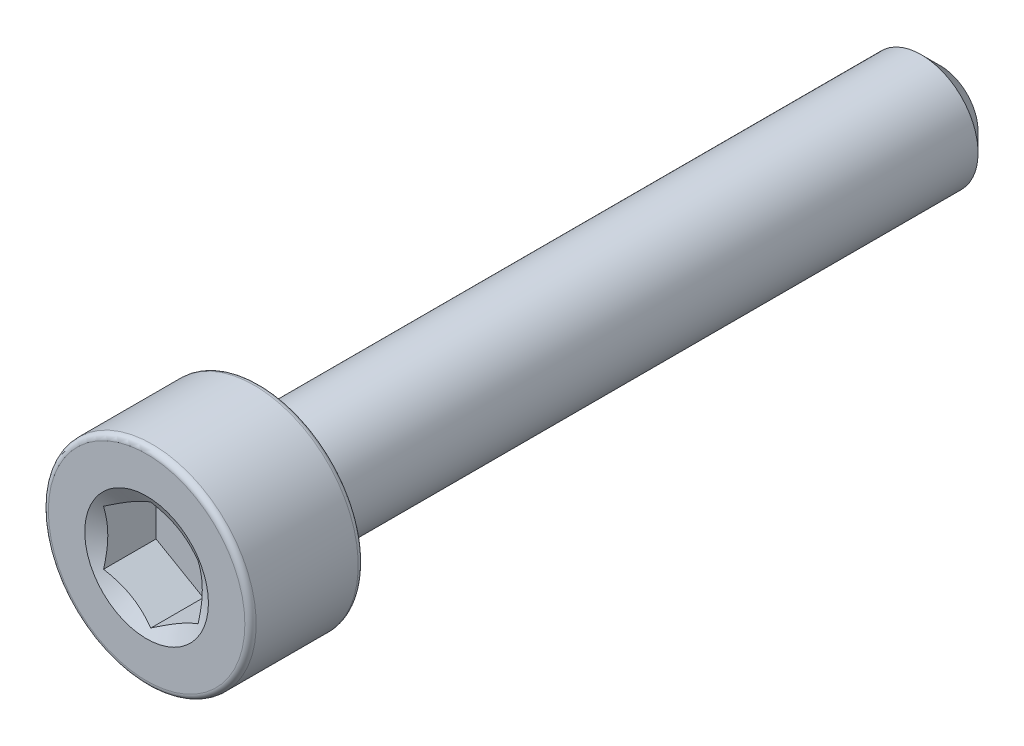
ISO-10303-21;
HEADER;
FILE_DESCRIPTION(('STEP AP214'),'2;1');
FILE_NAME('part.step','',(''),(''),'','','');
FILE_SCHEMA(('AUTOMOTIVE_DESIGN { 1 0 10303 214 1 1 1 1 }'));
ENDSEC;
DATA;
#1=APPLICATION_CONTEXT('core data for automotive mechanical design processes');
#2=APPLICATION_PROTOCOL_DEFINITION('international standard','automotive_design',2000,#1);
#3=PRODUCT_CONTEXT('',#1,'mechanical');
#4=PRODUCT('Part','Part','',(#3));
#5=PRODUCT_RELATED_PRODUCT_CATEGORY('part','',(#4));
#6=PRODUCT_DEFINITION_FORMATION('','',#4);
#7=PRODUCT_DEFINITION_CONTEXT('part definition',#1,'design');
#8=PRODUCT_DEFINITION('design','',#6,#7);
#9=PRODUCT_DEFINITION_SHAPE('','',#8);
#10=(LENGTH_UNIT() NAMED_UNIT(*) SI_UNIT(.MILLI.,.METRE.));
#11=(NAMED_UNIT(*) PLANE_ANGLE_UNIT() SI_UNIT($,.RADIAN.));
#12=(NAMED_UNIT(*) SI_UNIT($,.STERADIAN.) SOLID_ANGLE_UNIT());
#13=UNCERTAINTY_MEASURE_WITH_UNIT(LENGTH_MEASURE(1.E-05),#10,'distance_accuracy_value','');
#14=(GEOMETRIC_REPRESENTATION_CONTEXT(3) GLOBAL_UNCERTAINTY_ASSIGNED_CONTEXT((#13)) GLOBAL_UNIT_ASSIGNED_CONTEXT((#10,
#11,#12)) REPRESENTATION_CONTEXT('',''));
#15=CARTESIAN_POINT('',(0.,0.,0.));
#16=DIRECTION('',(0.,0.,1.));
#17=DIRECTION('',(1.,0.,0.));
#18=AXIS2_PLACEMENT_3D('',#15,#16,#17);
#19=CARTESIAN_POINT('',(0.,0.,-10.5));
#20=DIRECTION('',(0.,0.,-1.));
#21=DIRECTION('',(-1.,0.,0.));
#22=AXIS2_PLACEMENT_3D('',#19,#20,#21);
#23=PLANE('',#22);
#24=CARTESIAN_POINT('',(0.,0.,-10.5));
#25=DIRECTION('',(0.,0.,-1.));
#26=DIRECTION('',(-1.,0.,0.));
#27=AXIS2_PLACEMENT_3D('',#24,#25,#26);
#28=CIRCLE('',#27,1.00000000000001);
#29=CARTESIAN_POINT('',(-1.00000000000001,0.,-10.5));
#30=VERTEX_POINT('',#29);
#31=EDGE_CURVE('E59',#30,#30,#28,.T.);
#32=ORIENTED_EDGE('',*,*,#31,.T.);
#33=EDGE_LOOP('',(#32));
#34=FACE_BOUND('',#33,.T.);
#35=ADVANCED_FACE('F45',(#34),#23,.T.);
#36=CARTESIAN_POINT('',(0.,0.,-10.5));
#37=DIRECTION('',(0.,0.,1.));
#38=DIRECTION('',(1.,0.,0.));
#39=AXIS2_PLACEMENT_3D('',#36,#37,#38);
#40=CONICAL_SURFACE('',#39,1.00000000000001,0.785398163397449);
#41=CARTESIAN_POINT('',(0.,0.,-10.));
#42=DIRECTION('',(0.,0.,-1.));
#43=DIRECTION('',(-1.,0.,0.));
#44=AXIS2_PLACEMENT_3D('',#41,#42,#43);
#45=CIRCLE('',#44,1.50000000000001);
#46=CARTESIAN_POINT('',(-1.50000000000001,0.,-10.));
#47=VERTEX_POINT('',#46);
#48=EDGE_CURVE('E153',#47,#47,#45,.T.);
#49=ORIENTED_EDGE('',*,*,#48,.T.);
#50=EDGE_LOOP('',(#49));
#51=FACE_BOUND('',#50,.T.);
#52=ORIENTED_EDGE('',*,*,#31,.F.);
#53=EDGE_LOOP('',(#52));
#54=FACE_BOUND('',#53,.T.);
#55=ADVANCED_FACE('F161',(#51,#54),#40,.T.);
#56=CARTESIAN_POINT('',(0.,0.,-10.5));
#57=DIRECTION('',(0.,0.,-1.));
#58=DIRECTION('',(-1.,0.,0.));
#59=AXIS2_PLACEMENT_3D('',#56,#57,#58);
#60=CYLINDRICAL_SURFACE('',#59,1.50000000000001);
#61=CARTESIAN_POINT('',(0.,0.,7.5));
#62=DIRECTION('',(0.,0.,-1.));
#63=DIRECTION('',(-1.,0.,0.));
#64=AXIS2_PLACEMENT_3D('',#61,#62,#63);
#65=CIRCLE('',#64,1.5);
#66=CARTESIAN_POINT('',(-1.5,0.,7.5));
#67=VERTEX_POINT('',#66);
#68=EDGE_CURVE('E149',#67,#67,#65,.T.);
#69=ORIENTED_EDGE('',*,*,#68,.T.);
#70=EDGE_LOOP('',(#69));
#71=FACE_BOUND('',#70,.T.);
#72=ORIENTED_EDGE('',*,*,#48,.F.);
#73=EDGE_LOOP('',(#72));
#74=FACE_BOUND('',#73,.T.);
#75=ADVANCED_FACE('F163',(#71,#74),#60,.T.);
#76=CARTESIAN_POINT('',(0.,1.5,7.5));
#77=DIRECTION('',(0.,0.,-1.));
#78=DIRECTION('',(-1.,0.,0.));
#79=AXIS2_PLACEMENT_3D('',#76,#77,#78);
#80=PLANE('',#79);
#81=CARTESIAN_POINT('',(0.,0.,7.5));
#82=DIRECTION('',(0.,0.,-1.));
#83=DIRECTION('',(-1.,0.,0.));
#84=AXIS2_PLACEMENT_3D('',#81,#82,#83);
#85=CIRCLE('',#84,2.6);
#86=CARTESIAN_POINT('',(-2.6,0.,7.5));
#87=VERTEX_POINT('',#86);
#88=EDGE_CURVE('E145',#87,#87,#85,.T.);
#89=ORIENTED_EDGE('',*,*,#88,.T.);
#90=EDGE_LOOP('',(#89));
#91=FACE_BOUND('',#90,.T.);
#92=ORIENTED_EDGE('',*,*,#68,.F.);
#93=EDGE_LOOP('',(#92));
#94=FACE_BOUND('',#93,.T.);
#95=ADVANCED_FACE('F169',(#91,#94),#80,.T.);
#96=CARTESIAN_POINT('',(0.,0.,7.65));
#97=DIRECTION('',(0.,0.,-1.));
#98=DIRECTION('',(-1.,0.,0.));
#99=AXIS2_PLACEMENT_3D('',#96,#97,#98);
#100=TOROIDAL_SURFACE('',#99,2.6,0.15);
#101=CARTESIAN_POINT('',(0.,0.,7.65));
#102=DIRECTION('',(0.,0.,-1.));
#103=DIRECTION('',(-1.,0.,0.));
#104=AXIS2_PLACEMENT_3D('',#101,#102,#103);
#105=CIRCLE('',#104,2.75);
#106=CARTESIAN_POINT('',(-2.75,0.,7.65));
#107=VERTEX_POINT('',#106);
#108=EDGE_CURVE('E141',#107,#107,#105,.T.);
#109=ORIENTED_EDGE('',*,*,#108,.T.);
#110=EDGE_LOOP('',(#109));
#111=FACE_BOUND('',#110,.T.);
#112=ORIENTED_EDGE('',*,*,#88,.F.);
#113=EDGE_LOOP('',(#112));
#114=FACE_BOUND('',#113,.T.);
#115=ADVANCED_FACE('F175',(#111,#114),#100,.T.);
#116=CARTESIAN_POINT('',(0.,0.,-10.5));
#117=DIRECTION('',(0.,0.,-1.));
#118=DIRECTION('',(-1.,0.,0.));
#119=AXIS2_PLACEMENT_3D('',#116,#117,#118);
#120=CYLINDRICAL_SURFACE('',#119,2.75);
#121=CARTESIAN_POINT('',(0.,0.,10.35));
#122=DIRECTION('',(0.,0.,-1.));
#123=DIRECTION('',(-1.,0.,0.));
#124=AXIS2_PLACEMENT_3D('',#121,#122,#123);
#125=CIRCLE('',#124,2.75);
#126=CARTESIAN_POINT('',(-2.75,0.,10.35));
#127=VERTEX_POINT('',#126);
#128=EDGE_CURVE('E137',#127,#127,#125,.T.);
#129=ORIENTED_EDGE('',*,*,#128,.T.);
#130=EDGE_LOOP('',(#129));
#131=FACE_BOUND('',#130,.T.);
#132=ORIENTED_EDGE('',*,*,#108,.F.);
#133=EDGE_LOOP('',(#132));
#134=FACE_BOUND('',#133,.T.);
#135=ADVANCED_FACE('F179',(#131,#134),#120,.T.);
#136=CARTESIAN_POINT('',(0.,0.,10.35));
#137=DIRECTION('',(0.,0.,-1.));
#138=DIRECTION('',(-1.,0.,0.));
#139=AXIS2_PLACEMENT_3D('',#136,#137,#138);
#140=TOROIDAL_SURFACE('',#139,2.6,0.15);
#141=CARTESIAN_POINT('',(0.,0.,10.5));
#142=DIRECTION('',(0.,0.,-1.));
#143=DIRECTION('',(-1.,0.,0.));
#144=AXIS2_PLACEMENT_3D('',#141,#142,#143);
#145=CIRCLE('',#144,2.6);
#146=CARTESIAN_POINT('',(-2.6,0.,10.5));
#147=VERTEX_POINT('',#146);
#148=EDGE_CURVE('E133',#147,#147,#145,.T.);
#149=ORIENTED_EDGE('',*,*,#148,.T.);
#150=EDGE_LOOP('',(#149));
#151=FACE_BOUND('',#150,.T.);
#152=ORIENTED_EDGE('',*,*,#128,.F.);
#153=EDGE_LOOP('',(#152));
#154=FACE_BOUND('',#153,.T.);
#155=ADVANCED_FACE('F183',(#151,#154),#140,.T.);
#156=CARTESIAN_POINT('',(0.,2.6,10.5));
#157=DIRECTION('',(0.,0.,1.));
#158=DIRECTION('',(1.,0.,0.));
#159=AXIS2_PLACEMENT_3D('',#156,#157,#158);
#160=PLANE('',#159);
#161=CARTESIAN_POINT('',(0.,0.,10.5));
#162=DIRECTION('',(0.,0.,1.));
#163=DIRECTION('',(1.,0.,0.));
#164=AXIS2_PLACEMENT_3D('',#161,#162,#163);
#165=CIRCLE('',#164,1.63614639414505);
#166=CARTESIAN_POINT('',(1.63614639414505,0.,10.5));
#167=VERTEX_POINT('',#166);
#168=EDGE_CURVE('E291',#167,#167,#165,.T.);
#169=ORIENTED_EDGE('',*,*,#168,.F.);
#170=EDGE_LOOP('',(#169));
#171=FACE_BOUND('',#170,.T.);
#172=ORIENTED_EDGE('',*,*,#148,.F.);
#173=EDGE_LOOP('',(#172));
#174=FACE_BOUND('',#173,.T.);
#175=ADVANCED_FACE('F187',(#171,#174),#160,.T.);
#176=CARTESIAN_POINT('',(0.,0.,10.5));
#177=DIRECTION('',(0.,0.,1.));
#178=DIRECTION('',(1.,0.,0.));
#179=AXIS2_PLACEMENT_3D('',#176,#177,#178);
#180=CONICAL_SURFACE('',#179,1.63614639414505,1.0471975511966);
#181=ORIENTED_EDGE('',*,*,#168,.T.);
#182=EDGE_LOOP('',(#181));
#183=FACE_BOUND('',#182,.T.);
#184=CARTESIAN_POINT('',(1.2502,0.721572366433195,10.3887704469061));
#185=CARTESIAN_POINT('',(1.19526669476823,0.75328812499623,10.3704496870037));
#186=CARTESIAN_POINT('',(1.13985921349976,0.785277649221703,10.3537870784407));
#187=CARTESIAN_POINT('',(1.02808463239966,0.849810733708404,10.3247010761858));
#188=CARTESIAN_POINT('',(0.971715545158286,0.882355441401182,10.3122879742161));
#189=CARTESIAN_POINT('',(0.859676025913012,0.947041487997317,10.2929634598761));
#190=CARTESIAN_POINT('',(0.804022841540767,0.979172868975893,10.2859234616875));
#191=CARTESIAN_POINT('',(0.692454346091606,1.04358696985655,10.2775162048707));
#192=CARTESIAN_POINT('',(0.636539441062397,1.07586945532687,10.2761419874448));
#193=CARTESIAN_POINT('',(0.532042078818273,1.13620103554812,10.278987109608));
#194=CARTESIAN_POINT('',(0.483444050118682,1.16425912049992,10.2825078710601));
#195=CARTESIAN_POINT('',(0.38656463782676,1.22019247526559,10.2936708849393));
#196=CARTESIAN_POINT('',(0.338283589807835,1.24806755133608,10.3013169578127));
#197=CARTESIAN_POINT('',(0.241204116145956,1.30411641158755,10.3204332269406));
#198=CARTESIAN_POINT('',(0.1924179896481,1.33228309485381,10.3319845292197));
#199=CARTESIAN_POINT('',(0.095573747707898,1.38819614400745,10.3582020869339));
#200=CARTESIAN_POINT('',(0.0475143896730361,1.41594322730595,10.3728621743792));
#201=CARTESIAN_POINT('',(-0.00019999999999937,1.4434911430279,10.3887704469061));
#202=B_SPLINE_CURVE_WITH_KNOTS('',3,(#184,#185,#186,#187,#188,#189,#190,#191,#192,#193,#194,
#195,#196,#197,#198,#199,#200,#201),.UNSPECIFIED.,.F.,.F.,(4,2,2,2,2,2,2,2,4),(0.,
0.198150821029559,0.396778196315219,0.590488617354398,0.783961049317179,0.952480056398643,
1.12115539730009,1.29357430343589,1.4656542697693),.UNSPECIFIED.);
#203=CARTESIAN_POINT('',(1.25,0.721687836487033,10.3887037722401));
#204=VERTEX_POINT('',#203);
#205=CARTESIAN_POINT('',(0.,1.44337567297406,10.3887037722401));
#206=VERTEX_POINT('',#205);
#207=EDGE_CURVE('E114',#204,#206,#202,.T.);
#208=ORIENTED_EDGE('',*,*,#207,.F.);
#209=CARTESIAN_POINT('',(1.25,-1.89493751841897,10.8660049161367));
#210=CARTESIAN_POINT('',(1.25,-1.84067066556792,10.8398591369801));
#211=CARTESIAN_POINT('',(1.25,-1.78627450163045,10.813977180104));
#212=CARTESIAN_POINT('',(1.25,-1.67715428612257,10.7628901449648));
#213=CARTESIAN_POINT('',(1.25,-1.62243018009227,10.737685183164));
#214=CARTESIAN_POINT('',(1.25,-1.51228150662671,10.6879651495794));
#215=CARTESIAN_POINT('',(1.25,-1.45685471366198,10.6634549865724));
#216=CARTESIAN_POINT('',(1.25,-1.34554530713432,10.6154991246428));
#217=CARTESIAN_POINT('',(1.25,-1.28966271673333,10.5920533720234));
#218=CARTESIAN_POINT('',(1.25,-1.17576624469794,10.5458644070182));
#219=CARTESIAN_POINT('',(1.25,-1.11773662340457,10.5231594973456));
#220=CARTESIAN_POINT('',(1.25,-1.00099484940808,10.4795841161114));
#221=CARTESIAN_POINT('',(1.25,-0.942282613121023,10.4587138719349));
#222=CARTESIAN_POINT('',(1.25,-0.765204349699312,10.3997072191848));
#223=CARTESIAN_POINT('',(1.25,-0.645583882604636,10.3650422189823));
#224=CARTESIAN_POINT('',(1.25,-0.463875702211922,10.3244838282877));
#225=CARTESIAN_POINT('',(1.25,-0.403068506127652,10.3128844610448));
#226=CARTESIAN_POINT('',(1.25,-0.280742753477133,10.2942518454792));
#227=CARTESIAN_POINT('',(1.25,-0.219224254752231,10.2872182285025));
#228=CARTESIAN_POINT('',(1.25,-0.0965698763633008,10.2783680226508));
#229=CARTESIAN_POINT('',(1.25,-0.0354387064012569,10.2764878457648));
#230=CARTESIAN_POINT('',(1.25,0.0867606380980666,10.2779328141762));
#231=CARTESIAN_POINT('',(1.25,0.14782880910327,10.2812582369791));
#232=CARTESIAN_POINT('',(1.25,0.296976974537503,10.2954442054338));
#233=CARTESIAN_POINT('',(1.25,0.384798095194578,10.3090299024726));
#234=CARTESIAN_POINT('',(1.25,0.558777035598955,10.3444719080705));
#235=CARTESIAN_POINT('',(1.25,0.644932779103955,10.3663379185543));
#236=CARTESIAN_POINT('',(1.25,0.77380914521683,10.4038729521391));
#237=CARTESIAN_POINT('',(1.25,0.817192381770243,10.4173527933513));
#238=CARTESIAN_POINT('',(1.25,0.903507427606639,10.4456064722738));
#239=CARTESIAN_POINT('',(1.25,0.946439496819678,10.4603795133203));
#240=CARTESIAN_POINT('',(1.25,1.03190818876533,10.4910007062678));
#241=CARTESIAN_POINT('',(1.25,1.07444487146017,10.5068486920207));
#242=CARTESIAN_POINT('',(1.25,1.15917932142556,10.5394435314668));
#243=CARTESIAN_POINT('',(1.25,1.20137703158446,10.5561905331241));
#244=CARTESIAN_POINT('',(1.25,1.31147066876873,10.6010154406074));
#245=CARTESIAN_POINT('',(1.25,1.37912101231521,10.629695951964));
#246=CARTESIAN_POINT('',(1.25,1.51378271027518,10.6885240272895));
#247=CARTESIAN_POINT('',(1.25,1.58079400938027,10.7186717168868));
#248=CARTESIAN_POINT('',(1.25,1.78108956690742,10.810786011249));
#249=CARTESIAN_POINT('',(1.25,1.91360872407254,10.8744125929199));
#250=CARTESIAN_POINT('',(1.25,2.1774904257741,11.0044258505658));
#251=CARTESIAN_POINT('',(1.25,2.3088511775619,11.0708161192718));
#252=CARTESIAN_POINT('',(1.25,2.57065126493254,11.2053391118779));
#253=CARTESIAN_POINT('',(1.25,2.70109073234425,11.2734715797604));
#254=CARTESIAN_POINT('',(1.25,2.948502633735,11.4041482033026));
#255=CARTESIAN_POINT('',(1.25,3.06553428022911,11.4665806590823));
#256=CARTESIAN_POINT('',(1.25,3.29922001609874,11.5921595961625));
#257=CARTESIAN_POINT('',(1.25,3.41587408905205,11.6553061079975));
#258=CARTESIAN_POINT('',(1.25,3.64856969129762,11.7819563109881));
#259=CARTESIAN_POINT('',(1.25,3.76461202239064,11.8454585309991));
#260=CARTESIAN_POINT('',(1.25,3.99646186524789,11.9728743669845));
#261=CARTESIAN_POINT('',(1.25,4.1122693903372,12.036787958703));
#262=CARTESIAN_POINT('',(1.25,4.2279932107486,12.1008518334656));
#263=B_SPLINE_CURVE_WITH_KNOTS('',3,(#209,#210,#211,#212,#213,#214,#215,#216,#217,#218,#219,
#220,#221,#222,#223,#224,#225,#226,#227,#228,#229,#230,#231,#232,#233,#234,#235,#236,#237,#238,
#239,#240,#241,#242,#243,#244,#245,#246,#247,#248,#249,#250,#251,#252,#253,#254,#255,#256,#257,
#258,#259,#260,#261,#262),.UNSPECIFIED.,.F.,.F.,(4,2,2,2,2,2,2,2,2,2,2,2,2,2,2,2,2,2,2,2,2,2,2,
2,2,2,4),(0.,0.180713106713346,0.361457104680117,0.543260352914665,0.725054419431095,
0.911961247339337,1.09889120758174,1.4717330826098,1.65730634847845,1.84286462866529,
2.02612278279417,2.20939070656818,2.47544204670161,2.74180608477099,2.87807807884381,
3.01426670678608,3.15043433259021,3.28662443861176,3.50703539675674,3.72746526112046,
4.1684120268283,4.60995110059888,5.05142565856186,5.44935247283763,5.84729636804963,
6.24413951205772,6.64095946715193),.UNSPECIFIED.);
#264=CARTESIAN_POINT('',(1.25,-0.721687836487029,10.38870377224));
#265=VERTEX_POINT('',#264);
#266=EDGE_CURVE('E233',#265,#204,#263,.T.);
#267=ORIENTED_EDGE('',*,*,#266,.F.);
#268=CARTESIAN_POINT('',(-0.000200000000002283,-1.4434911430279,10.3887704469061));
#269=CARTESIAN_POINT('',(0.0547333052317625,-1.41177538446486,10.3704496870037));
#270=CARTESIAN_POINT('',(0.110140786500237,-1.37978586023939,10.3537870784407));
#271=CARTESIAN_POINT('',(0.221915367600337,-1.31525277575269,10.3247010761858));
#272=CARTESIAN_POINT('',(0.278284454841707,-1.28270806805991,10.3122879742161));
#273=CARTESIAN_POINT('',(0.39032397408698,-1.21802202146378,10.2929634598761));
#274=CARTESIAN_POINT('',(0.445977158459225,-1.1858906404852,10.2859234616875));
#275=CARTESIAN_POINT('',(0.557545653908387,-1.12147653960455,10.2775162048707));
#276=CARTESIAN_POINT('',(0.613460558937595,-1.08919405413422,10.2761419874448));
#277=CARTESIAN_POINT('',(0.71795792118172,-1.02886247391297,10.278987109608));
#278=CARTESIAN_POINT('',(0.766555949881311,-1.00080438896117,10.2825078710601));
#279=CARTESIAN_POINT('',(0.863435362173233,-0.9448710341955,10.2936708849393));
#280=CARTESIAN_POINT('',(0.911716410192158,-0.916995958125017,10.3013169578127));
#281=CARTESIAN_POINT('',(1.00879588385404,-0.860947097873543,10.3204332269406));
#282=CARTESIAN_POINT('',(1.05758201035189,-0.832780414607287,10.3319845292197));
#283=CARTESIAN_POINT('',(1.1544262522921,-0.776867365453645,10.3582020869339));
#284=CARTESIAN_POINT('',(1.20248561032696,-0.749120282155137,10.3728621743792));
#285=CARTESIAN_POINT('',(1.2502,-0.721572366433191,10.3887704469061));
#286=B_SPLINE_CURVE_WITH_KNOTS('',3,(#268,#269,#270,#271,#272,#273,#274,#275,#276,#277,#278,
#279,#280,#281,#282,#283,#284,#285),.UNSPECIFIED.,.F.,.F.,(4,2,2,2,2,2,2,2,4),(0.,
0.198150821029559,0.396778196315219,0.590488617354398,0.783961049317179,0.952480056398644,
1.12115539730009,1.2935743034359,1.4656542697693),.UNSPECIFIED.);
#287=CARTESIAN_POINT('',(0.,-1.44337567297406,10.38870377224));
#288=VERTEX_POINT('',#287);
#289=EDGE_CURVE('E227',#288,#265,#286,.T.);
#290=ORIENTED_EDGE('',*,*,#289,.F.);
#291=CARTESIAN_POINT('',(-1.2502,-0.721572366433193,10.3887704469061));
#292=CARTESIAN_POINT('',(-1.19526669476823,-0.753288124996229,10.3704496870037));
#293=CARTESIAN_POINT('',(-1.13985921349976,-0.785277649221701,10.3537870784407));
#294=CARTESIAN_POINT('',(-1.02808463239966,-0.849810733708402,10.3247010761858));
#295=CARTESIAN_POINT('',(-0.971715545158288,-0.88235544140118,10.3122879742161));
#296=CARTESIAN_POINT('',(-0.859676025913014,-0.947041487997316,10.2929634598761));
#297=CARTESIAN_POINT('',(-0.804022841540769,-0.979172868975891,10.2859234616875));
#298=CARTESIAN_POINT('',(-0.692454346091607,-1.04358696985655,10.2775162048707));
#299=CARTESIAN_POINT('',(-0.636539441062399,-1.07586945532687,10.2761419874448));
#300=CARTESIAN_POINT('',(-0.532042078818275,-1.13620103554812,10.278987109608));
#301=CARTESIAN_POINT('',(-0.483444050118684,-1.16425912049992,10.2825078710601));
#302=CARTESIAN_POINT('',(-0.386564637826762,-1.22019247526559,10.2936708849393));
#303=CARTESIAN_POINT('',(-0.338283589807837,-1.24806755133607,10.3013169578127));
#304=CARTESIAN_POINT('',(-0.241204116145958,-1.30411641158755,10.3204332269406));
#305=CARTESIAN_POINT('',(-0.192417989648102,-1.3322830948538,10.3319845292197));
#306=CARTESIAN_POINT('',(-0.0955737477078996,-1.38819614400744,10.3582020869339));
#307=CARTESIAN_POINT('',(-0.0475143896730376,-1.41594322730595,10.3728621743792));
#308=CARTESIAN_POINT('',(0.000199999999997632,-1.4434911430279,10.3887704469061));
#309=B_SPLINE_CURVE_WITH_KNOTS('',3,(#291,#292,#293,#294,#295,#296,#297,#298,#299,#300,#301,
#302,#303,#304,#305,#306,#307,#308),.UNSPECIFIED.,.F.,.F.,(4,2,2,2,2,2,2,2,4),(0.,
0.198150821029559,0.39677819631522,0.590488617354398,0.783961049317179,0.952480056398643,
1.12115539730009,1.29357430343589,1.4656542697693),.UNSPECIFIED.);
#310=CARTESIAN_POINT('',(-1.25,-0.721687836487031,10.3887037722401));
#311=VERTEX_POINT('',#310);
#312=EDGE_CURVE('E66',#311,#288,#309,.T.);
#313=ORIENTED_EDGE('',*,*,#312,.F.);
#314=CARTESIAN_POINT('',(-1.25,-1.89493751841898,10.8660049161367));
#315=CARTESIAN_POINT('',(-1.25,-1.84067066556792,10.8398591369801));
#316=CARTESIAN_POINT('',(-1.25,-1.78627450163045,10.8139771801041));
#317=CARTESIAN_POINT('',(-1.25,-1.67715428612257,10.7628901449648));
#318=CARTESIAN_POINT('',(-1.25,-1.62243018009227,10.737685183164));
#319=CARTESIAN_POINT('',(-1.25,-1.51228150662671,10.6879651495794));
#320=CARTESIAN_POINT('',(-1.25,-1.45685471366199,10.6634549865724));
#321=CARTESIAN_POINT('',(-1.25,-1.34554530713432,10.6154991246428));
#322=CARTESIAN_POINT('',(-1.25,-1.28966271673333,10.5920533720234));
#323=CARTESIAN_POINT('',(-1.25,-1.17576624469794,10.5458644070182));
#324=CARTESIAN_POINT('',(-1.25,-1.11773662340457,10.5231594973456));
#325=CARTESIAN_POINT('',(-1.25,-1.00099484940809,10.4795841161114));
#326=CARTESIAN_POINT('',(-1.25,-0.942282613121025,10.4587138719349));
#327=CARTESIAN_POINT('',(-1.25,-0.765204349699314,10.3997072191848));
#328=CARTESIAN_POINT('',(-1.25,-0.645583882604638,10.3650422189823));
#329=CARTESIAN_POINT('',(-1.25,-0.463875702211923,10.3244838282877));
#330=CARTESIAN_POINT('',(-1.25,-0.403068506127653,10.3128844610448));
#331=CARTESIAN_POINT('',(-1.25,-0.280742753477134,10.2942518454792));
#332=CARTESIAN_POINT('',(-1.25,-0.219224254752231,10.2872182285025));
#333=CARTESIAN_POINT('',(-1.25,-0.0965698763633012,10.2783680226508));
#334=CARTESIAN_POINT('',(-1.25,-0.0354387064012574,10.2764878457648));
#335=CARTESIAN_POINT('',(-1.25,0.0867606380980661,10.2779328141762));
#336=CARTESIAN_POINT('',(-1.25,0.147828809103269,10.2812582369791));
#337=CARTESIAN_POINT('',(-1.25,0.296976974537503,10.2954442054338));
#338=CARTESIAN_POINT('',(-1.25,0.384798095194577,10.3090299024726));
#339=CARTESIAN_POINT('',(-1.25,0.558777035598954,10.3444719080705));
#340=CARTESIAN_POINT('',(-1.25,0.644932779103954,10.3663379185543));
#341=CARTESIAN_POINT('',(-1.25,0.773809145216829,10.4038729521391));
#342=CARTESIAN_POINT('',(-1.25,0.817192381770242,10.4173527933513));
#343=CARTESIAN_POINT('',(-1.25,0.903507427606639,10.4456064722738));
#344=CARTESIAN_POINT('',(-1.25,0.946439496819678,10.4603795133203));
#345=CARTESIAN_POINT('',(-1.25,1.03190818876533,10.4910007062678));
#346=CARTESIAN_POINT('',(-1.25,1.07444487146017,10.5068486920207));
#347=CARTESIAN_POINT('',(-1.25,1.15917932142556,10.5394435314668));
#348=CARTESIAN_POINT('',(-1.25,1.20137703158446,10.5561905331241));
#349=CARTESIAN_POINT('',(-1.25,1.31147066876873,10.6010154406074));
#350=CARTESIAN_POINT('',(-1.25,1.37912101231521,10.629695951964));
#351=CARTESIAN_POINT('',(-1.25,1.51378271027518,10.6885240272895));
#352=CARTESIAN_POINT('',(-1.25,1.58079400938027,10.7186717168868));
#353=CARTESIAN_POINT('',(-1.25,1.78108956690742,10.810786011249));
#354=CARTESIAN_POINT('',(-1.25,1.91360872407254,10.8744125929199));
#355=CARTESIAN_POINT('',(-1.25,2.1774904257741,11.0044258505658));
#356=CARTESIAN_POINT('',(-1.25,2.3088511775619,11.0708161192718));
#357=CARTESIAN_POINT('',(-1.25,2.57065126493254,11.2053391118779));
#358=CARTESIAN_POINT('',(-1.25,2.70109073234425,11.2734715797604));
#359=CARTESIAN_POINT('',(-1.25,2.948502633735,11.4041482033026));
#360=CARTESIAN_POINT('',(-1.25,3.06553428022911,11.4665806590823));
#361=CARTESIAN_POINT('',(-1.25,3.29922001609874,11.5921595961625));
#362=CARTESIAN_POINT('',(-1.25,3.41587408905205,11.6553061079975));
#363=CARTESIAN_POINT('',(-1.25,3.64856969129762,11.7819563109881));
#364=CARTESIAN_POINT('',(-1.25,3.76461202239064,11.8454585309991));
#365=CARTESIAN_POINT('',(-1.25,3.99646186524789,11.9728743669845));
#366=CARTESIAN_POINT('',(-1.25,4.1122693903372,12.036787958703));
#367=CARTESIAN_POINT('',(-1.25,4.2279932107486,12.1008518334656));
#368=B_SPLINE_CURVE_WITH_KNOTS('',3,(#314,#315,#316,#317,#318,#319,#320,#321,#322,#323,#324,
#325,#326,#327,#328,#329,#330,#331,#332,#333,#334,#335,#336,#337,#338,#339,#340,#341,#342,#343,
#344,#345,#346,#347,#348,#349,#350,#351,#352,#353,#354,#355,#356,#357,#358,#359,#360,#361,#362,
#363,#364,#365,#366,#367),.UNSPECIFIED.,.F.,.F.,(4,2,2,2,2,2,2,2,2,2,2,2,2,2,2,2,2,2,2,2,2,2,2,
2,2,2,4),(0.,0.180713106713345,0.361457104680117,0.543260352914666,0.725054419431094,
0.911961247339336,1.09889120758174,1.4717330826098,1.65730634847845,1.84286462866529,
2.02612278279417,2.20939070656818,2.47544204670161,2.74180608477099,2.87807807884381,
3.01426670678608,3.15043433259021,3.28662443861176,3.50703539675674,3.72746526112046,
4.1684120268283,4.60995110059888,5.05142565856186,5.44935247283763,5.84729636804963,
6.24413951205772,6.64095946715193),.UNSPECIFIED.);
#369=CARTESIAN_POINT('',(-1.25,0.721687836487031,10.3887037722401));
#370=VERTEX_POINT('',#369);
#371=EDGE_CURVE('E11',#370,#311,#368,.F.);
#372=ORIENTED_EDGE('',*,*,#371,.F.);
#373=CARTESIAN_POINT('',(0.000200000000000317,1.4434911430279,10.3887704469061));
#374=CARTESIAN_POINT('',(-0.0547333052317649,1.41177538446486,10.3704496870037));
#375=CARTESIAN_POINT('',(-0.110140786500239,1.37978586023939,10.3537870784407));
#376=CARTESIAN_POINT('',(-0.221915367600339,1.31525277575269,10.3247010761858));
#377=CARTESIAN_POINT('',(-0.278284454841709,1.28270806805991,10.3122879742161));
#378=CARTESIAN_POINT('',(-0.390323974086983,1.21802202146378,10.2929634598761));
#379=CARTESIAN_POINT('',(-0.445977158459228,1.1858906404852,10.2859234616875));
#380=CARTESIAN_POINT('',(-0.557545653908389,1.12147653960455,10.2775162048707));
#381=CARTESIAN_POINT('',(-0.613460558937598,1.08919405413422,10.2761419874448));
#382=CARTESIAN_POINT('',(-0.717957921181722,1.02886247391297,10.278987109608));
#383=CARTESIAN_POINT('',(-0.766555949881313,1.00080438896118,10.2825078710601));
#384=CARTESIAN_POINT('',(-0.863435362173236,0.944871034195502,10.2936708849393));
#385=CARTESIAN_POINT('',(-0.911716410192161,0.916995958125018,10.3013169578127));
#386=CARTESIAN_POINT('',(-1.00879588385404,0.860947097873545,10.3204332269406));
#387=CARTESIAN_POINT('',(-1.0575820103519,0.832780414607288,10.3319845292197));
#388=CARTESIAN_POINT('',(-1.1544262522921,0.776867365453647,10.3582020869339));
#389=CARTESIAN_POINT('',(-1.20248561032696,0.749120282155139,10.3728621743792));
#390=CARTESIAN_POINT('',(-1.2502,0.721572366433193,10.3887704469061));
#391=B_SPLINE_CURVE_WITH_KNOTS('',3,(#373,#374,#375,#376,#377,#378,#379,#380,#381,#382,#383,
#384,#385,#386,#387,#388,#389,#390),.UNSPECIFIED.,.F.,.F.,(4,2,2,2,2,2,2,2,4),(0.,
0.198150821029559,0.396778196315219,0.590488617354398,0.783961049317179,0.952480056398644,
1.1211553973001,1.2935743034359,1.4656542697693),.UNSPECIFIED.);
#392=EDGE_CURVE('E104',#206,#370,#391,.T.);
#393=ORIENTED_EDGE('',*,*,#392,.F.);
#394=EDGE_LOOP('',(#208,#267,#290,#313,#372,#393));
#395=FACE_BOUND('',#394,.T.);
#396=ADVANCED_FACE('F103',(#183,#395),#180,.F.);
#397=CARTESIAN_POINT('',(0.,0.,9.));
#398=DIRECTION('',(0.,0.,1.));
#399=DIRECTION('',(1.,0.,0.));
#400=AXIS2_PLACEMENT_3D('',#397,#398,#399);
#401=PLANE('',#400);
#402=DIRECTION('',(-0.866025403784439,-0.5,0.));
#403=VECTOR('',#402,1.);
#404=CARTESIAN_POINT('',(0.,1.44337567297406,9.));
#405=LINE('',#404,#403);
#406=CARTESIAN_POINT('',(0.,1.44337567297406,9.));
#407=VERTEX_POINT('',#406);
#408=CARTESIAN_POINT('',(-1.25,0.721687836487031,9.));
#409=VERTEX_POINT('',#408);
#410=EDGE_CURVE('E113',#407,#409,#405,.T.);
#411=ORIENTED_EDGE('',*,*,#410,.T.);
#412=DIRECTION('',(0.,-1.,0.));
#413=VECTOR('',#412,1.);
#414=CARTESIAN_POINT('',(-1.25,0.721687836487031,9.));
#415=LINE('',#414,#413);
#416=CARTESIAN_POINT('',(-1.25,-0.721687836487031,9.));
#417=VERTEX_POINT('',#416);
#418=EDGE_CURVE('E118',#409,#417,#415,.T.);
#419=ORIENTED_EDGE('',*,*,#418,.T.);
#420=DIRECTION('',(0.866025403784439,-0.5,0.));
#421=VECTOR('',#420,1.);
#422=CARTESIAN_POINT('',(-1.25,-0.721687836487031,9.));
#423=LINE('',#422,#421);
#424=CARTESIAN_POINT('',(0.,-1.44337567297406,9.));
#425=VERTEX_POINT('',#424);
#426=EDGE_CURVE('E260',#417,#425,#423,.T.);
#427=ORIENTED_EDGE('',*,*,#426,.T.);
#428=DIRECTION('',(0.866025403784438,0.5,0.));
#429=VECTOR('',#428,1.);
#430=CARTESIAN_POINT('',(0.,-1.44337567297406,9.));
#431=LINE('',#430,#429);
#432=CARTESIAN_POINT('',(1.25,-0.721687836487029,9.));
#433=VERTEX_POINT('',#432);
#434=EDGE_CURVE('E265',#425,#433,#431,.T.);
#435=ORIENTED_EDGE('',*,*,#434,.T.);
#436=DIRECTION('',(0.,1.,0.));
#437=VECTOR('',#436,1.);
#438=CARTESIAN_POINT('',(1.25,-0.721687836487029,9.));
#439=LINE('',#438,#437);
#440=CARTESIAN_POINT('',(1.25,0.721687836487033,9.));
#441=VERTEX_POINT('',#440);
#442=EDGE_CURVE('E129',#433,#441,#439,.T.);
#443=ORIENTED_EDGE('',*,*,#442,.T.);
#444=DIRECTION('',(-0.866025403784439,0.5,0.));
#445=VECTOR('',#444,1.);
#446=CARTESIAN_POINT('',(1.25,0.721687836487033,9.));
#447=LINE('',#446,#445);
#448=EDGE_CURVE('E122',#441,#407,#447,.T.);
#449=ORIENTED_EDGE('',*,*,#448,.T.);
#450=EDGE_LOOP('',(#411,#419,#427,#435,#443,#449));
#451=FACE_BOUND('',#450,.T.);
#452=ADVANCED_FACE('F213',(#451),#401,.T.);
#453=CARTESIAN_POINT('',(-1.25,0.721687836487031,9.));
#454=DIRECTION('',(-1.,0.,0.));
#455=DIRECTION('',(0.,-1.,0.));
#456=AXIS2_PLACEMENT_3D('',#453,#454,#455);
#457=PLANE('',#456);
#458=DIRECTION('',(0.,0.,1.));
#459=VECTOR('',#458,1.);
#460=CARTESIAN_POINT('',(-1.25,0.721687836487031,9.));
#461=LINE('',#460,#459);
#462=EDGE_CURVE('E110',#409,#370,#461,.T.);
#463=ORIENTED_EDGE('',*,*,#462,.T.);
#464=ORIENTED_EDGE('',*,*,#371,.T.);
#465=DIRECTION('',(0.,0.,1.));
#466=VECTOR('',#465,1.);
#467=CARTESIAN_POINT('',(-1.25,-0.721687836487031,9.));
#468=LINE('',#467,#466);
#469=EDGE_CURVE('E121',#417,#311,#468,.T.);
#470=ORIENTED_EDGE('',*,*,#469,.F.);
#471=ORIENTED_EDGE('',*,*,#418,.F.);
#472=EDGE_LOOP('',(#463,#464,#470,#471));
#473=FACE_BOUND('',#472,.T.);
#474=ADVANCED_FACE('F116',(#473),#457,.F.);
#475=CARTESIAN_POINT('',(-1.25,-0.721687836487031,9.));
#476=DIRECTION('',(-0.5,-0.866025403784439,0.));
#477=DIRECTION('',(0.866025403784439,-0.5,0.));
#478=AXIS2_PLACEMENT_3D('',#475,#476,#477);
#479=PLANE('',#478);
#480=ORIENTED_EDGE('',*,*,#469,.T.);
#481=ORIENTED_EDGE('',*,*,#312,.T.);
#482=DIRECTION('',(0.,0.,1.));
#483=VECTOR('',#482,1.);
#484=CARTESIAN_POINT('',(0.,-1.44337567297406,9.));
#485=LINE('',#484,#483);
#486=EDGE_CURVE('E126',#425,#288,#485,.T.);
#487=ORIENTED_EDGE('',*,*,#486,.F.);
#488=ORIENTED_EDGE('',*,*,#426,.F.);
#489=EDGE_LOOP('',(#480,#481,#487,#488));
#490=FACE_BOUND('',#489,.T.);
#491=ADVANCED_FACE('F249',(#490),#479,.F.);
#492=CARTESIAN_POINT('',(0.,-1.44337567297406,9.));
#493=DIRECTION('',(0.5,-0.866025403784438,0.));
#494=DIRECTION('',(0.866025403784438,0.5,0.));
#495=AXIS2_PLACEMENT_3D('',#492,#493,#494);
#496=PLANE('',#495);
#497=ORIENTED_EDGE('',*,*,#486,.T.);
#498=ORIENTED_EDGE('',*,*,#289,.T.);
#499=DIRECTION('',(0.,0.,1.));
#500=VECTOR('',#499,1.);
#501=CARTESIAN_POINT('',(1.25,-0.721687836487029,9.));
#502=LINE('',#501,#500);
#503=EDGE_CURVE('E281',#433,#265,#502,.T.);
#504=ORIENTED_EDGE('',*,*,#503,.F.);
#505=ORIENTED_EDGE('',*,*,#434,.F.);
#506=EDGE_LOOP('',(#497,#498,#504,#505));
#507=FACE_BOUND('',#506,.T.);
#508=ADVANCED_FACE('F244',(#507),#496,.F.);
#509=CARTESIAN_POINT('',(1.25,-0.721687836487029,9.));
#510=DIRECTION('',(1.,0.,0.));
#511=DIRECTION('',(0.,1.,0.));
#512=AXIS2_PLACEMENT_3D('',#509,#510,#511);
#513=PLANE('',#512);
#514=ORIENTED_EDGE('',*,*,#503,.T.);
#515=ORIENTED_EDGE('',*,*,#266,.T.);
#516=DIRECTION('',(0.,0.,1.));
#517=VECTOR('',#516,1.);
#518=CARTESIAN_POINT('',(1.25,0.721687836487033,9.));
#519=LINE('',#518,#517);
#520=EDGE_CURVE('E277',#441,#204,#519,.T.);
#521=ORIENTED_EDGE('',*,*,#520,.F.);
#522=ORIENTED_EDGE('',*,*,#442,.F.);
#523=EDGE_LOOP('',(#514,#515,#521,#522));
#524=FACE_BOUND('',#523,.T.);
#525=ADVANCED_FACE('F241',(#524),#513,.F.);
#526=CARTESIAN_POINT('',(1.25,0.721687836487033,9.));
#527=DIRECTION('',(0.5,0.866025403784439,0.));
#528=DIRECTION('',(-0.866025403784439,0.5,0.));
#529=AXIS2_PLACEMENT_3D('',#526,#527,#528);
#530=PLANE('',#529);
#531=ORIENTED_EDGE('',*,*,#520,.T.);
#532=ORIENTED_EDGE('',*,*,#207,.T.);
#533=DIRECTION('',(0.,0.,1.));
#534=VECTOR('',#533,1.);
#535=CARTESIAN_POINT('',(0.,1.44337567297406,9.));
#536=LINE('',#535,#534);
#537=EDGE_CURVE('E73',#407,#206,#536,.T.);
#538=ORIENTED_EDGE('',*,*,#537,.F.);
#539=ORIENTED_EDGE('',*,*,#448,.F.);
#540=EDGE_LOOP('',(#531,#532,#538,#539));
#541=FACE_BOUND('',#540,.T.);
#542=ADVANCED_FACE('F194',(#541),#530,.F.);
#543=CARTESIAN_POINT('',(0.,1.44337567297406,9.));
#544=DIRECTION('',(-0.5,0.866025403784438,0.));
#545=DIRECTION('',(-0.866025403784439,-0.5,0.));
#546=AXIS2_PLACEMENT_3D('',#543,#544,#545);
#547=PLANE('',#546);
#548=ORIENTED_EDGE('',*,*,#537,.T.);
#549=ORIENTED_EDGE('',*,*,#392,.T.);
#550=ORIENTED_EDGE('',*,*,#462,.F.);
#551=ORIENTED_EDGE('',*,*,#410,.F.);
#552=EDGE_LOOP('',(#548,#549,#550,#551));
#553=FACE_BOUND('',#552,.T.);
#554=ADVANCED_FACE('F109',(#553),#547,.F.);
#555=CLOSED_SHELL('',(#35,#55,#75,#95,#115,#135,#155,#175,#396,#452,#474,#491,#508,#525,#542,#554));
#556=MANIFOLD_SOLID_BREP('B2',#555);
#557=ADVANCED_BREP_SHAPE_REPRESENTATION('',(#18,#556),#14);
#558=SHAPE_DEFINITION_REPRESENTATION(#9,#557);
ENDSEC;
END-ISO-10303-21;
